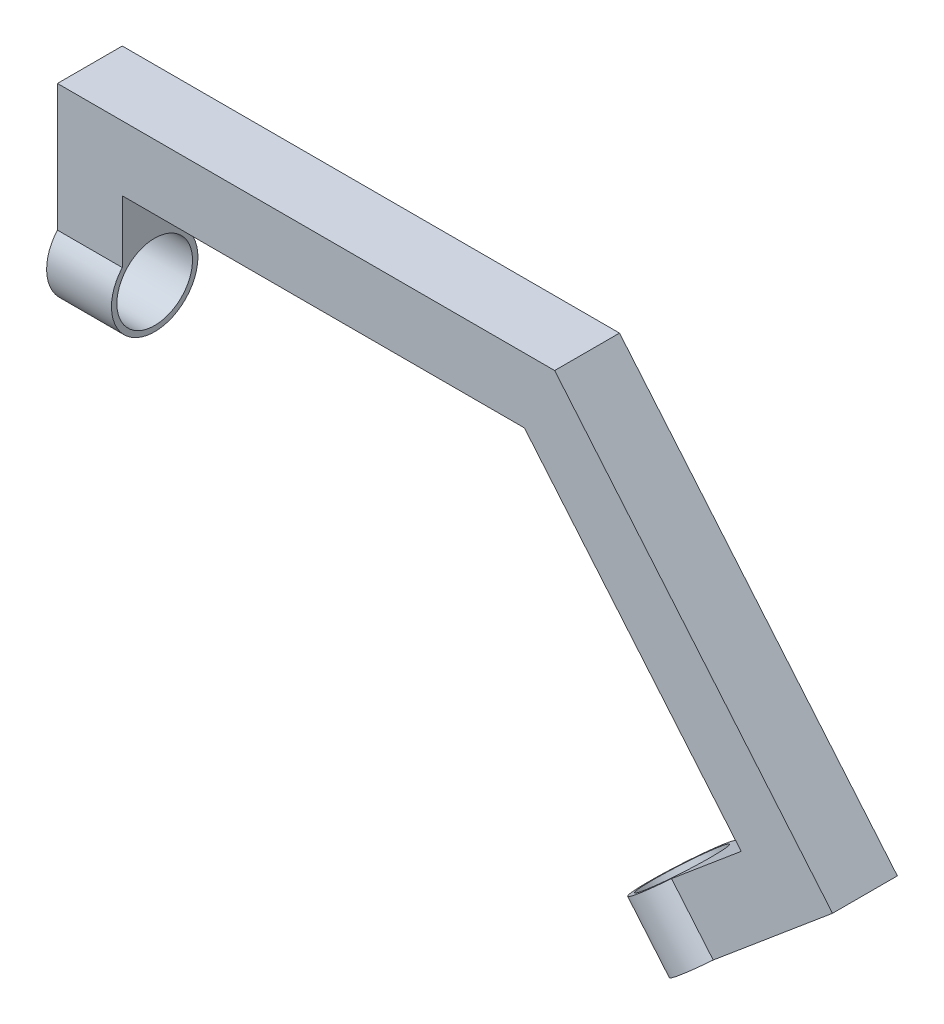
ISO-10303-21;
HEADER;
FILE_DESCRIPTION(('STEP AP214'),'2;1');
FILE_NAME('part.step','',(''),(''),'','','');
FILE_SCHEMA(('AUTOMOTIVE_DESIGN { 1 0 10303 214 1 1 1 1 }'));
ENDSEC;
DATA;
#1=APPLICATION_CONTEXT('core data for automotive mechanical design processes');
#2=APPLICATION_PROTOCOL_DEFINITION('international standard','automotive_design',2000,#1);
#3=PRODUCT_CONTEXT('',#1,'mechanical');
#4=PRODUCT('Part','Part','',(#3));
#5=PRODUCT_RELATED_PRODUCT_CATEGORY('part','',(#4));
#6=PRODUCT_DEFINITION_FORMATION('','',#4);
#7=PRODUCT_DEFINITION_CONTEXT('part definition',#1,'design');
#8=PRODUCT_DEFINITION('design','',#6,#7);
#9=PRODUCT_DEFINITION_SHAPE('','',#8);
#10=(LENGTH_UNIT() NAMED_UNIT(*) SI_UNIT(.MILLI.,.METRE.));
#11=(NAMED_UNIT(*) PLANE_ANGLE_UNIT() SI_UNIT($,.RADIAN.));
#12=(NAMED_UNIT(*) SI_UNIT($,.STERADIAN.) SOLID_ANGLE_UNIT());
#13=UNCERTAINTY_MEASURE_WITH_UNIT(LENGTH_MEASURE(1.E-05),#10,'distance_accuracy_value','');
#14=(GEOMETRIC_REPRESENTATION_CONTEXT(3) GLOBAL_UNCERTAINTY_ASSIGNED_CONTEXT((#13)) GLOBAL_UNIT_ASSIGNED_CONTEXT((#10,
#11,#12)) REPRESENTATION_CONTEXT('',''));
#15=CARTESIAN_POINT('',(0.,0.,0.));
#16=DIRECTION('',(0.,0.,1.));
#17=DIRECTION('',(1.,0.,0.));
#18=AXIS2_PLACEMENT_3D('',#15,#16,#17);
#19=CARTESIAN_POINT('',(41.5140780336129,28.5123762302024,-9.525));
#20=DIRECTION('',(-0.766044443118979,-0.642787609686538,0.));
#21=DIRECTION('',(0.642787609686538,-0.766044443118979,0.));
#22=AXIS2_PLACEMENT_3D('',#19,#20,#21);
#23=PLANE('',#22);
#24=DIRECTION('',(0.,0.,1.));
#25=VECTOR('',#24,1.);
#26=CARTESIAN_POINT('',(41.5140780336129,28.5123762302024,-9.525));
#27=LINE('',#26,#25);
#28=CARTESIAN_POINT('',(41.5140780336129,28.5123762302024,-9.525));
#29=VERTEX_POINT('',#28);
#30=CARTESIAN_POINT('',(41.5140780336129,28.5123762302024,9.525));
#31=VERTEX_POINT('',#30);
#32=EDGE_CURVE('E181',#29,#31,#27,.T.);
#33=ORIENTED_EDGE('',*,*,#32,.T.);
#34=DIRECTION('',(0.642787609686538,-0.766044443118979,0.));
#35=VECTOR('',#34,1.);
#36=CARTESIAN_POINT('',(41.5140780336129,28.5123762302024,9.525));
#37=LINE('',#36,#35);
#38=CARTESIAN_POINT('',(-22.1648586784853,104.401977829425,9.525));
#39=VERTEX_POINT('',#38);
#40=EDGE_CURVE('E147',#39,#31,#37,.T.);
#41=ORIENTED_EDGE('',*,*,#40,.F.);
#42=DIRECTION('',(0.,0.,1.));
#43=VECTOR('',#42,1.);
#44=CARTESIAN_POINT('',(-22.1648586784853,104.401977829425,-9.525));
#45=LINE('',#44,#43);
#46=CARTESIAN_POINT('',(-22.1648586784853,104.401977829425,-9.525));
#47=VERTEX_POINT('',#46);
#48=EDGE_CURVE('E182',#47,#39,#45,.T.);
#49=ORIENTED_EDGE('',*,*,#48,.F.);
#50=DIRECTION('',(0.642787609686538,-0.766044443118979,0.));
#51=VECTOR('',#50,1.);
#52=CARTESIAN_POINT('',(41.5140780336129,28.5123762302024,-9.525));
#53=LINE('',#52,#51);
#54=EDGE_CURVE('E161',#47,#29,#53,.T.);
#55=ORIENTED_EDGE('',*,*,#54,.T.);
#56=EDGE_LOOP('',(#33,#41,#49,#55));
#57=FACE_BOUND('',#56,.T.);
#58=ADVANCED_FACE('F33',(#57),#23,.T.);
#59=CARTESIAN_POINT('',(-140.313745494589,104.401977829425,-9.525));
#60=DIRECTION('',(0.,-1.,0.));
#61=DIRECTION('',(0.,0.,-1.));
#62=AXIS2_PLACEMENT_3D('',#59,#60,#61);
#63=PLANE('',#62);
#64=ORIENTED_EDGE('',*,*,#48,.T.);
#65=DIRECTION('',(1.,0.,0.));
#66=VECTOR('',#65,1.);
#67=CARTESIAN_POINT('',(-140.313745494589,104.401977829425,9.525));
#68=LINE('',#67,#66);
#69=CARTESIAN_POINT('',(-140.313745494589,104.401977829425,9.525));
#70=VERTEX_POINT('',#69);
#71=EDGE_CURVE('E158',#70,#39,#68,.T.);
#72=ORIENTED_EDGE('',*,*,#71,.F.);
#73=DIRECTION('',(0.,0.,1.));
#74=VECTOR('',#73,1.);
#75=CARTESIAN_POINT('',(-140.313745494589,104.401977829425,-9.525));
#76=LINE('',#75,#74);
#77=CARTESIAN_POINT('',(-140.313745494589,104.401977829425,-9.525));
#78=VERTEX_POINT('',#77);
#79=EDGE_CURVE('E184',#78,#70,#76,.T.);
#80=ORIENTED_EDGE('',*,*,#79,.F.);
#81=DIRECTION('',(1.,0.,0.));
#82=VECTOR('',#81,1.);
#83=CARTESIAN_POINT('',(-140.313745494589,104.401977829425,-9.525));
#84=LINE('',#83,#82);
#85=EDGE_CURVE('E178',#78,#47,#84,.T.);
#86=ORIENTED_EDGE('',*,*,#85,.T.);
#87=EDGE_LOOP('',(#64,#72,#80,#86));
#88=FACE_BOUND('',#87,.T.);
#89=ADVANCED_FACE('F225',(#88),#63,.T.);
#90=CARTESIAN_POINT('',(-140.313745494589,77.7319778294249,-9.525));
#91=DIRECTION('',(1.,0.,0.));
#92=DIRECTION('',(0.,0.,-1.));
#93=AXIS2_PLACEMENT_3D('',#90,#91,#92);
#94=PLANE('',#93);
#95=CARTESIAN_POINT('',(-140.313745494589,77.7319778294249,0.));
#96=DIRECTION('',(-1.,0.,0.));
#97=DIRECTION('',(0.,0.,1.));
#98=AXIS2_PLACEMENT_3D('',#95,#96,#97);
#99=CIRCLE('',#98,11.1125);
#100=CARTESIAN_POINT('',(-140.313745494589,77.7319778294249,11.1125));
#101=VERTEX_POINT('',#100);
#102=EDGE_CURVE('E250',#101,#101,#99,.T.);
#103=ORIENTED_EDGE('',*,*,#102,.T.);
#104=EDGE_LOOP('',(#103));
#105=FACE_BOUND('',#104,.T.);
#106=DIRECTION('',(0.,1.,0.));
#107=VECTOR('',#106,1.);
#108=CARTESIAN_POINT('',(-140.313745494589,77.7319778294249,9.525));
#109=LINE('',#108,#107);
#110=CARTESIAN_POINT('',(-140.313745494589,86.132238242055,9.525));
#111=VERTEX_POINT('',#110);
#112=EDGE_CURVE('E156',#111,#70,#109,.T.);
#113=ORIENTED_EDGE('',*,*,#112,.F.);
#114=CARTESIAN_POINT('',(-140.313745494589,77.7319778294249,0.));
#115=DIRECTION('',(-1.,0.,0.));
#116=DIRECTION('',(0.,0.,1.));
#117=AXIS2_PLACEMENT_3D('',#114,#115,#116);
#118=CIRCLE('',#117,12.7);
#119=CARTESIAN_POINT('',(-140.313745494589,86.132238242055,-9.525));
#120=VERTEX_POINT('',#119);
#121=EDGE_CURVE('E139',#120,#111,#118,.T.);
#122=ORIENTED_EDGE('',*,*,#121,.F.);
#123=DIRECTION('',(0.,1.,0.));
#124=VECTOR('',#123,1.);
#125=CARTESIAN_POINT('',(-140.313745494589,77.7319778294249,-9.525));
#126=LINE('',#125,#124);
#127=EDGE_CURVE('E176',#120,#78,#126,.T.);
#128=ORIENTED_EDGE('',*,*,#127,.T.);
#129=ORIENTED_EDGE('',*,*,#79,.T.);
#130=EDGE_LOOP('',(#113,#122,#128,#129));
#131=FACE_BOUND('',#130,.T.);
#132=ADVANCED_FACE('F199',(#105,#131),#94,.T.);
#133=CARTESIAN_POINT('',(-159.363745494589,77.7319778294249,-9.525));
#134=DIRECTION('',(-1.,0.,0.));
#135=DIRECTION('',(0.,0.,1.));
#136=AXIS2_PLACEMENT_3D('',#133,#134,#135);
#137=PLANE('',#136);
#138=CARTESIAN_POINT('',(-159.363745494589,77.7319778294249,0.));
#139=DIRECTION('',(-1.,0.,0.));
#140=DIRECTION('',(0.,0.,1.));
#141=AXIS2_PLACEMENT_3D('',#138,#139,#140);
#142=CIRCLE('',#141,11.1125);
#143=CARTESIAN_POINT('',(-159.363745494589,77.7319778294249,11.1125));
#144=VERTEX_POINT('',#143);
#145=EDGE_CURVE('E252',#144,#144,#142,.T.);
#146=ORIENTED_EDGE('',*,*,#145,.F.);
#147=EDGE_LOOP('',(#146));
#148=FACE_BOUND('',#147,.T.);
#149=DIRECTION('',(0.,-1.,0.));
#150=VECTOR('',#149,1.);
#151=CARTESIAN_POINT('',(-159.363745494589,77.7319778294249,-9.525));
#152=LINE('',#151,#150);
#153=CARTESIAN_POINT('',(-159.363745494589,123.451977829425,-9.525));
#154=VERTEX_POINT('',#153);
#155=CARTESIAN_POINT('',(-159.363745494589,86.132238242055,-9.525));
#156=VERTEX_POINT('',#155);
#157=EDGE_CURVE('E173',#154,#156,#152,.T.);
#158=ORIENTED_EDGE('',*,*,#157,.T.);
#159=CARTESIAN_POINT('',(-159.363745494589,77.7319778294249,0.));
#160=DIRECTION('',(-1.,0.,0.));
#161=DIRECTION('',(0.,0.,1.));
#162=AXIS2_PLACEMENT_3D('',#159,#160,#161);
#163=CIRCLE('',#162,12.7);
#164=CARTESIAN_POINT('',(-159.363745494589,86.132238242055,9.525));
#165=VERTEX_POINT('',#164);
#166=EDGE_CURVE('E138',#156,#165,#163,.T.);
#167=ORIENTED_EDGE('',*,*,#166,.T.);
#168=DIRECTION('',(0.,-1.,0.));
#169=VECTOR('',#168,1.);
#170=CARTESIAN_POINT('',(-159.363745494589,77.7319778294249,9.525));
#171=LINE('',#170,#169);
#172=CARTESIAN_POINT('',(-159.363745494589,123.451977829425,9.525));
#173=VERTEX_POINT('',#172);
#174=EDGE_CURVE('E154',#173,#165,#171,.T.);
#175=ORIENTED_EDGE('',*,*,#174,.F.);
#176=DIRECTION('',(0.,0.,1.));
#177=VECTOR('',#176,1.);
#178=CARTESIAN_POINT('',(-159.363745494589,123.451977829425,-9.525));
#179=LINE('',#178,#177);
#180=EDGE_CURVE('E187',#154,#173,#179,.T.);
#181=ORIENTED_EDGE('',*,*,#180,.F.);
#182=EDGE_LOOP('',(#158,#167,#175,#181));
#183=FACE_BOUND('',#182,.T.);
#184=ADVANCED_FACE('F208',(#148,#183),#137,.T.);
#185=CARTESIAN_POINT('',(-159.363745494589,123.451977829425,-9.525));
#186=DIRECTION('',(0.,1.,0.));
#187=DIRECTION('',(-1.,0.,0.));
#188=AXIS2_PLACEMENT_3D('',#185,#186,#187);
#189=PLANE('',#188);
#190=ORIENTED_EDGE('',*,*,#180,.T.);
#191=DIRECTION('',(-1.,0.,0.));
#192=VECTOR('',#191,1.);
#193=CARTESIAN_POINT('',(-159.363745494589,123.451977829425,9.525));
#194=LINE('',#193,#192);
#195=CARTESIAN_POINT('',(-13.2816977906321,123.451977829425,9.525));
#196=VERTEX_POINT('',#195);
#197=EDGE_CURVE('E151',#196,#173,#194,.T.);
#198=ORIENTED_EDGE('',*,*,#197,.F.);
#199=DIRECTION('',(0.,0.,1.));
#200=VECTOR('',#199,1.);
#201=CARTESIAN_POINT('',(-13.2816977906321,123.451977829425,-9.525));
#202=LINE('',#201,#200);
#203=CARTESIAN_POINT('',(-13.2816977906321,123.451977829425,-9.525));
#204=VERTEX_POINT('',#203);
#205=EDGE_CURVE('E189',#204,#196,#202,.T.);
#206=ORIENTED_EDGE('',*,*,#205,.F.);
#207=DIRECTION('',(-1.,0.,0.));
#208=VECTOR('',#207,1.);
#209=CARTESIAN_POINT('',(-159.363745494589,123.451977829425,-9.525));
#210=LINE('',#209,#208);
#211=EDGE_CURVE('E170',#204,#154,#210,.T.);
#212=ORIENTED_EDGE('',*,*,#211,.T.);
#213=EDGE_LOOP('',(#190,#198,#206,#212));
#214=FACE_BOUND('',#213,.T.);
#215=ADVANCED_FACE('F211',(#214),#189,.T.);
#216=CARTESIAN_POINT('',(68.3523286395582,26.1643335533146,-9.525));
#217=DIRECTION('',(0.766044443118979,0.642787609686538,0.));
#218=DIRECTION('',(-0.642787609686538,0.766044443118979,0.));
#219=AXIS2_PLACEMENT_3D('',#216,#217,#218);
#220=PLANE('',#219);
#221=ORIENTED_EDGE('',*,*,#205,.T.);
#222=DIRECTION('',(-0.642787609686538,0.766044443118979,0.));
#223=VECTOR('',#222,1.);
#224=CARTESIAN_POINT('',(68.3523286395582,26.1643335533146,9.525));
#225=LINE('',#224,#223);
#226=CARTESIAN_POINT('',(68.3523286395582,26.1643335533146,9.525));
#227=VERTEX_POINT('',#226);
#228=EDGE_CURVE('E117',#227,#196,#225,.T.);
#229=ORIENTED_EDGE('',*,*,#228,.F.);
#230=DIRECTION('',(0.,0.,1.));
#231=VECTOR('',#230,1.);
#232=CARTESIAN_POINT('',(68.3523286395582,26.1643335533146,-9.525));
#233=LINE('',#232,#231);
#234=CARTESIAN_POINT('',(68.3523286395582,26.1643335533146,-9.525));
#235=VERTEX_POINT('',#234);
#236=EDGE_CURVE('E113',#235,#227,#233,.T.);
#237=ORIENTED_EDGE('',*,*,#236,.F.);
#238=DIRECTION('',(-0.642787609686538,0.766044443118979,0.));
#239=VECTOR('',#238,1.);
#240=CARTESIAN_POINT('',(68.3523286395582,26.1643335533146,-9.525));
#241=LINE('',#240,#239);
#242=EDGE_CURVE('E167',#235,#204,#241,.T.);
#243=ORIENTED_EDGE('',*,*,#242,.T.);
#244=EDGE_LOOP('',(#221,#229,#237,#243));
#245=FACE_BOUND('',#244,.T.);
#246=ADVANCED_FACE('F213',(#245),#220,.T.);
#247=CARTESIAN_POINT('',(26.8648606960573,-8.64778549655613,-9.525));
#248=DIRECTION('',(0.642787609686538,-0.766044443118979,0.));
#249=DIRECTION('',(0.766044443118979,0.642787609686538,0.));
#250=AXIS2_PLACEMENT_3D('',#247,#248,#249);
#251=PLANE('',#250);
#252=CARTESIAN_POINT('',(26.8648606960574,-8.6477854965561,0.));
#253=DIRECTION('',(0.642787609686538,-0.766044443118979,0.));
#254=DIRECTION('',(0.766044443118979,0.642787609686538,0.));
#255=AXIS2_PLACEMENT_3D('',#252,#253,#254);
#256=CIRCLE('',#255,11.1125);
#257=CARTESIAN_POINT('',(35.377529570217,-1.50480818391444,0.));
#258=VERTEX_POINT('',#257);
#259=EDGE_CURVE('E133',#258,#258,#256,.T.);
#260=ORIENTED_EDGE('',*,*,#259,.F.);
#261=EDGE_LOOP('',(#260));
#262=FACE_BOUND('',#261,.T.);
#263=DIRECTION('',(0.766044443118979,0.642787609686538,0.));
#264=VECTOR('',#263,1.);
#265=CARTESIAN_POINT('',(26.8648606960573,-8.64778549655613,9.525));
#266=LINE('',#265,#264);
#267=CARTESIAN_POINT('',(33.299833505905,-3.24820218517716,9.525));
#268=VERTEX_POINT('',#267);
#269=EDGE_CURVE('E108',#268,#227,#266,.T.);
#270=ORIENTED_EDGE('',*,*,#269,.F.);
#271=CARTESIAN_POINT('',(26.8648606960574,-8.6477854965561,0.));
#272=DIRECTION('',(0.642787609686538,-0.766044443118979,0.));
#273=DIRECTION('',(0.766044443118979,0.642787609686538,0.));
#274=AXIS2_PLACEMENT_3D('',#271,#272,#273);
#275=CIRCLE('',#274,12.7);
#276=CARTESIAN_POINT('',(33.299833505905,-3.24820218517716,-9.525));
#277=VERTEX_POINT('',#276);
#278=EDGE_CURVE('E111',#268,#277,#275,.T.);
#279=ORIENTED_EDGE('',*,*,#278,.T.);
#280=DIRECTION('',(0.766044443118979,0.642787609686538,0.));
#281=VECTOR('',#280,1.);
#282=CARTESIAN_POINT('',(26.8648606960573,-8.64778549655613,-9.525));
#283=LINE('',#282,#281);
#284=EDGE_CURVE('E52',#277,#235,#283,.T.);
#285=ORIENTED_EDGE('',*,*,#284,.T.);
#286=ORIENTED_EDGE('',*,*,#236,.T.);
#287=EDGE_LOOP('',(#270,#279,#285,#286));
#288=FACE_BOUND('',#287,.T.);
#289=ADVANCED_FACE('F109',(#262,#288),#251,.T.);
#290=CARTESIAN_POINT('',(14.6197567315288,5.94536114486046,-9.525));
#291=DIRECTION('',(-0.642787609686538,0.766044443118979,0.));
#292=DIRECTION('',(-0.766044443118979,-0.642787609686538,0.));
#293=AXIS2_PLACEMENT_3D('',#290,#291,#292);
#294=PLANE('',#293);
#295=CARTESIAN_POINT('',(14.6197567315288,5.94536114486046,0.));
#296=DIRECTION('',(0.642787609686538,-0.766044443118979,0.));
#297=DIRECTION('',(0.766044443118979,0.642787609686538,0.));
#298=AXIS2_PLACEMENT_3D('',#295,#296,#297);
#299=CIRCLE('',#298,11.1125);
#300=CARTESIAN_POINT('',(23.1324256056885,13.0883384575021,0.));
#301=VERTEX_POINT('',#300);
#302=EDGE_CURVE('E129',#301,#301,#299,.T.);
#303=ORIENTED_EDGE('',*,*,#302,.T.);
#304=EDGE_LOOP('',(#303));
#305=FACE_BOUND('',#304,.T.);
#306=DIRECTION('',(-0.766044443118979,-0.642787609686538,0.));
#307=VECTOR('',#306,1.);
#308=CARTESIAN_POINT('',(14.6197567315288,5.94536114486046,-9.525));
#309=LINE('',#308,#307);
#310=CARTESIAN_POINT('',(21.0547295413764,11.3449444562394,-9.525));
#311=VERTEX_POINT('',#310);
#312=EDGE_CURVE('E164',#29,#311,#309,.T.);
#313=ORIENTED_EDGE('',*,*,#312,.T.);
#314=CARTESIAN_POINT('',(14.6197567315288,5.94536114486046,0.));
#315=DIRECTION('',(0.642787609686538,-0.766044443118979,0.));
#316=DIRECTION('',(0.766044443118979,0.642787609686538,0.));
#317=AXIS2_PLACEMENT_3D('',#314,#315,#316);
#318=CIRCLE('',#317,12.7);
#319=CARTESIAN_POINT('',(21.0547295413764,11.3449444562394,9.525));
#320=VERTEX_POINT('',#319);
#321=EDGE_CURVE('E128',#320,#311,#318,.T.);
#322=ORIENTED_EDGE('',*,*,#321,.F.);
#323=DIRECTION('',(-0.766044443118979,-0.642787609686538,0.));
#324=VECTOR('',#323,1.);
#325=CARTESIAN_POINT('',(14.6197567315288,5.94536114486046,9.525));
#326=LINE('',#325,#324);
#327=EDGE_CURVE('E118',#31,#320,#326,.T.);
#328=ORIENTED_EDGE('',*,*,#327,.F.);
#329=ORIENTED_EDGE('',*,*,#32,.F.);
#330=EDGE_LOOP('',(#313,#322,#328,#329));
#331=FACE_BOUND('',#330,.T.);
#332=ADVANCED_FACE('F220',(#305,#331),#294,.T.);
#333=CARTESIAN_POINT('',(0.,0.,-9.525));
#334=DIRECTION('',(0.,0.,-1.));
#335=DIRECTION('',(-1.,0.,0.));
#336=AXIS2_PLACEMENT_3D('',#333,#334,#335);
#337=PLANE('',#336);
#338=DIRECTION('',(0.642787609686538,-0.766044443118979,0.));
#339=VECTOR('',#338,1.);
#340=CARTESIAN_POINT('',(21.0547295413764,11.3449444562394,-9.525));
#341=LINE('',#340,#339);
#342=EDGE_CURVE('E47',#311,#277,#341,.T.);
#343=ORIENTED_EDGE('',*,*,#342,.F.);
#344=ORIENTED_EDGE('',*,*,#312,.F.);
#345=ORIENTED_EDGE('',*,*,#54,.F.);
#346=ORIENTED_EDGE('',*,*,#85,.F.);
#347=ORIENTED_EDGE('',*,*,#127,.F.);
#348=DIRECTION('',(-1.,0.,0.));
#349=VECTOR('',#348,1.);
#350=CARTESIAN_POINT('',(-140.313745494589,86.132238242055,-9.525));
#351=LINE('',#350,#349);
#352=EDGE_CURVE('E142',#156,#120,#351,.F.);
#353=ORIENTED_EDGE('',*,*,#352,.F.);
#354=ORIENTED_EDGE('',*,*,#157,.F.);
#355=ORIENTED_EDGE('',*,*,#211,.F.);
#356=ORIENTED_EDGE('',*,*,#242,.F.);
#357=ORIENTED_EDGE('',*,*,#284,.F.);
#358=EDGE_LOOP('',(#343,#344,#345,#346,#347,#353,#354,#355,#356,#357));
#359=FACE_BOUND('',#358,.T.);
#360=ADVANCED_FACE('F204',(#359),#337,.T.);
#361=CARTESIAN_POINT('',(0.,0.,9.525));
#362=DIRECTION('',(0.,0.,-1.));
#363=DIRECTION('',(-1.,0.,0.));
#364=AXIS2_PLACEMENT_3D('',#361,#362,#363);
#365=PLANE('',#364);
#366=ORIENTED_EDGE('',*,*,#327,.T.);
#367=DIRECTION('',(0.642787609686538,-0.766044443118979,0.));
#368=VECTOR('',#367,1.);
#369=CARTESIAN_POINT('',(21.0547295413764,11.3449444562394,9.525));
#370=LINE('',#369,#368);
#371=EDGE_CURVE('E11',#320,#268,#370,.T.);
#372=ORIENTED_EDGE('',*,*,#371,.T.);
#373=ORIENTED_EDGE('',*,*,#269,.T.);
#374=ORIENTED_EDGE('',*,*,#228,.T.);
#375=ORIENTED_EDGE('',*,*,#197,.T.);
#376=ORIENTED_EDGE('',*,*,#174,.T.);
#377=DIRECTION('',(-1.,0.,0.));
#378=VECTOR('',#377,1.);
#379=CARTESIAN_POINT('',(-140.313745494589,86.132238242055,9.525));
#380=LINE('',#379,#378);
#381=EDGE_CURVE('E40',#165,#111,#380,.F.);
#382=ORIENTED_EDGE('',*,*,#381,.T.);
#383=ORIENTED_EDGE('',*,*,#112,.T.);
#384=ORIENTED_EDGE('',*,*,#71,.T.);
#385=ORIENTED_EDGE('',*,*,#40,.T.);
#386=EDGE_LOOP('',(#366,#372,#373,#374,#375,#376,#382,#383,#384,#385));
#387=FACE_BOUND('',#386,.T.);
#388=ADVANCED_FACE('F121',(#387),#365,.F.);
#389=CARTESIAN_POINT('',(-140.313745494589,77.7319778294249,0.));
#390=DIRECTION('',(-1.,0.,0.));
#391=DIRECTION('',(0.,0.,1.));
#392=AXIS2_PLACEMENT_3D('',#389,#390,#391);
#393=CYLINDRICAL_SURFACE('',#392,12.7);
#394=ORIENTED_EDGE('',*,*,#166,.F.);
#395=ORIENTED_EDGE('',*,*,#352,.T.);
#396=ORIENTED_EDGE('',*,*,#121,.T.);
#397=ORIENTED_EDGE('',*,*,#381,.F.);
#398=EDGE_LOOP('',(#394,#395,#396,#397));
#399=FACE_BOUND('',#398,.T.);
#400=ADVANCED_FACE('F202',(#399),#393,.T.);
#401=CARTESIAN_POINT('',(14.6197567315288,5.94536114486046,0.));
#402=DIRECTION('',(0.642787609686538,-0.766044443118979,0.));
#403=DIRECTION('',(0.766044443118979,0.642787609686538,0.));
#404=AXIS2_PLACEMENT_3D('',#401,#402,#403);
#405=CYLINDRICAL_SURFACE('',#404,12.7);
#406=ORIENTED_EDGE('',*,*,#321,.T.);
#407=ORIENTED_EDGE('',*,*,#342,.T.);
#408=ORIENTED_EDGE('',*,*,#278,.F.);
#409=ORIENTED_EDGE('',*,*,#371,.F.);
#410=EDGE_LOOP('',(#406,#407,#408,#409));
#411=FACE_BOUND('',#410,.T.);
#412=ADVANCED_FACE('F127',(#411),#405,.T.);
#413=CARTESIAN_POINT('',(14.6197567315288,5.94536114486046,0.));
#414=DIRECTION('',(0.642787609686538,-0.766044443118979,0.));
#415=DIRECTION('',(0.766044443118979,0.642787609686538,0.));
#416=AXIS2_PLACEMENT_3D('',#413,#414,#415);
#417=CYLINDRICAL_SURFACE('',#416,11.1125);
#418=ORIENTED_EDGE('',*,*,#302,.F.);
#419=EDGE_LOOP('',(#418));
#420=FACE_BOUND('',#419,.T.);
#421=ORIENTED_EDGE('',*,*,#259,.T.);
#422=EDGE_LOOP('',(#421));
#423=FACE_BOUND('',#422,.T.);
#424=ADVANCED_FACE('F243',(#420,#423),#417,.F.);
#425=CARTESIAN_POINT('',(-140.313745494589,77.7319778294249,0.));
#426=DIRECTION('',(-1.,0.,0.));
#427=DIRECTION('',(0.,0.,1.));
#428=AXIS2_PLACEMENT_3D('',#425,#426,#427);
#429=CYLINDRICAL_SURFACE('',#428,11.1125);
#430=ORIENTED_EDGE('',*,*,#102,.F.);
#431=EDGE_LOOP('',(#430));
#432=FACE_BOUND('',#431,.T.);
#433=ORIENTED_EDGE('',*,*,#145,.T.);
#434=EDGE_LOOP('',(#433));
#435=FACE_BOUND('',#434,.T.);
#436=ADVANCED_FACE('F246',(#432,#435),#429,.F.);
#437=CLOSED_SHELL('',(#58,#89,#132,#184,#215,#246,#289,#332,#360,#388,#400,#412,#424,#436));
#438=MANIFOLD_SOLID_BREP('B2',#437);
#439=ADVANCED_BREP_SHAPE_REPRESENTATION('',(#18,#438),#14);
#440=SHAPE_DEFINITION_REPRESENTATION(#9,#439);
ENDSEC;
END-ISO-10303-21;
